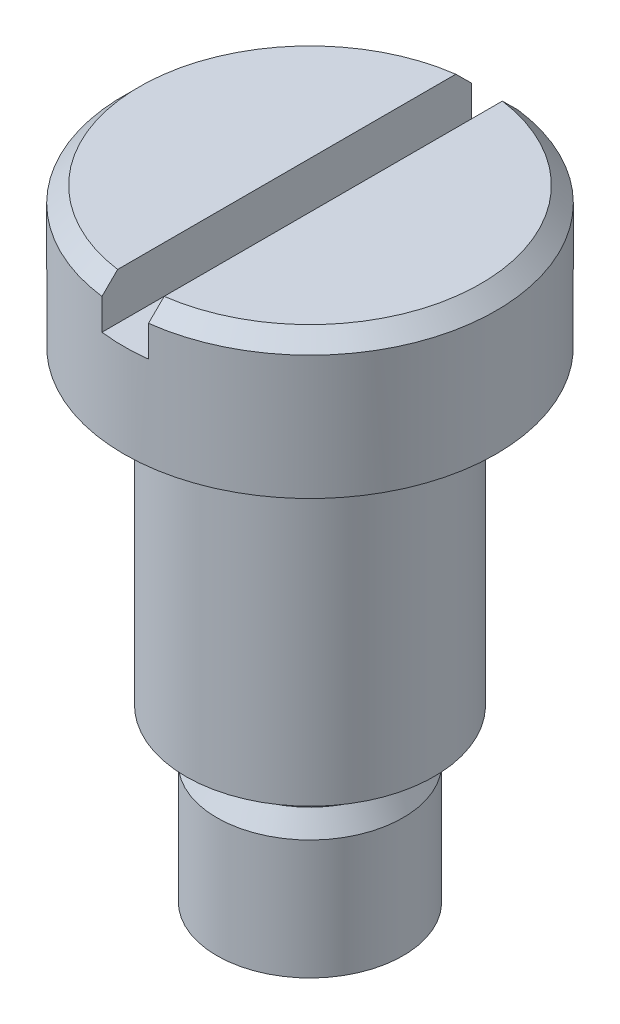
ISO-10303-21;
HEADER;
FILE_DESCRIPTION(('STEP AP214'),'2;1');
FILE_NAME('part.step','',(''),(''),'','','');
FILE_SCHEMA(('AUTOMOTIVE_DESIGN { 1 0 10303 214 1 1 1 1 }'));
ENDSEC;
DATA;
#1=APPLICATION_CONTEXT('core data for automotive mechanical design processes');
#2=APPLICATION_PROTOCOL_DEFINITION('international standard','automotive_design',2000,#1);
#3=PRODUCT_CONTEXT('',#1,'mechanical');
#4=PRODUCT('Part','Part','',(#3));
#5=PRODUCT_RELATED_PRODUCT_CATEGORY('part','',(#4));
#6=PRODUCT_DEFINITION_FORMATION('','',#4);
#7=PRODUCT_DEFINITION_CONTEXT('part definition',#1,'design');
#8=PRODUCT_DEFINITION('design','',#6,#7);
#9=PRODUCT_DEFINITION_SHAPE('','',#8);
#10=(LENGTH_UNIT() NAMED_UNIT(*) SI_UNIT(.MILLI.,.METRE.));
#11=(NAMED_UNIT(*) PLANE_ANGLE_UNIT() SI_UNIT($,.RADIAN.));
#12=(NAMED_UNIT(*) SI_UNIT($,.STERADIAN.) SOLID_ANGLE_UNIT());
#13=UNCERTAINTY_MEASURE_WITH_UNIT(LENGTH_MEASURE(1.E-05),#10,'distance_accuracy_value','');
#14=(GEOMETRIC_REPRESENTATION_CONTEXT(3) GLOBAL_UNCERTAINTY_ASSIGNED_CONTEXT((#13)) GLOBAL_UNIT_ASSIGNED_CONTEXT((#10,
#11,#12)) REPRESENTATION_CONTEXT('',''));
#15=CARTESIAN_POINT('',(0.,0.,0.));
#16=DIRECTION('',(0.,0.,1.));
#17=DIRECTION('',(1.,0.,0.));
#18=AXIS2_PLACEMENT_3D('',#15,#16,#17);
#19=CARTESIAN_POINT('',(0.,40.,0.));
#20=DIRECTION('',(0.,1.,0.));
#21=DIRECTION('',(0.,0.,1.));
#22=AXIS2_PLACEMENT_3D('',#19,#20,#21);
#23=PLANE('',#22);
#24=DIRECTION('',(0.,0.,1.));
#25=VECTOR('',#24,1.);
#26=CARTESIAN_POINT('',(-1.5,40.,-12.));
#27=LINE('',#26,#25);
#28=CARTESIAN_POINT('',(-1.5,40.,-10.8972473588517));
#29=VERTEX_POINT('',#28);
#30=CARTESIAN_POINT('',(-1.5,40.,10.8972473588517));
#31=VERTEX_POINT('',#30);
#32=EDGE_CURVE('E191',#29,#31,#27,.T.);
#33=ORIENTED_EDGE('',*,*,#32,.F.);
#34=CARTESIAN_POINT('',(0.,40.,0.));
#35=DIRECTION('',(0.,1.,0.));
#36=DIRECTION('',(0.,0.,1.));
#37=AXIS2_PLACEMENT_3D('',#34,#35,#36);
#38=CIRCLE('',#37,11.);
#39=EDGE_CURVE('E11',#29,#31,#38,.T.);
#40=ORIENTED_EDGE('',*,*,#39,.T.);
#41=EDGE_LOOP('',(#33,#40));
#42=FACE_BOUND('',#41,.T.);
#43=ADVANCED_FACE('F51',(#42),#23,.T.);
#44=DIRECTION('',(0.,0.,1.));
#45=VECTOR('',#44,1.);
#46=CARTESIAN_POINT('',(1.5,40.,-12.));
#47=LINE('',#46,#45);
#48=CARTESIAN_POINT('',(1.5,40.,-10.8972473588517));
#49=VERTEX_POINT('',#48);
#50=CARTESIAN_POINT('',(1.5,40.,10.8972473588517));
#51=VERTEX_POINT('',#50);
#52=EDGE_CURVE('E123',#49,#51,#47,.T.);
#53=ORIENTED_EDGE('',*,*,#52,.T.);
#54=CARTESIAN_POINT('',(0.,40.,0.));
#55=DIRECTION('',(0.,1.,0.));
#56=DIRECTION('',(0.,0.,1.));
#57=AXIS2_PLACEMENT_3D('',#54,#55,#56);
#58=CIRCLE('',#57,11.);
#59=EDGE_CURVE('E182',#51,#49,#58,.T.);
#60=ORIENTED_EDGE('',*,*,#59,.T.);
#61=EDGE_LOOP('',(#53,#60));
#62=FACE_BOUND('',#61,.T.);
#63=ADVANCED_FACE('F190',(#62),#23,.T.);
#64=CARTESIAN_POINT('',(0.,0.,0.));
#65=DIRECTION('',(0.,-1.,0.));
#66=DIRECTION('',(0.,0.,-1.));
#67=AXIS2_PLACEMENT_3D('',#64,#65,#66);
#68=CYLINDRICAL_SURFACE('',#67,12.);
#69=DIRECTION('',(0.,-1.,0.));
#70=VECTOR('',#69,1.);
#71=CARTESIAN_POINT('',(1.49999999999997,0.,-11.9058808997907));
#72=LINE('',#71,#70);
#73=CARTESIAN_POINT('',(1.49999999999997,39.,-11.9058808997907));
#74=VERTEX_POINT('',#73);
#75=CARTESIAN_POINT('',(1.5,37.,-11.9058808997907));
#76=VERTEX_POINT('',#75);
#77=EDGE_CURVE('E122',#74,#76,#72,.T.);
#78=ORIENTED_EDGE('',*,*,#77,.F.);
#79=CARTESIAN_POINT('',(0.,39.,0.));
#80=DIRECTION('',(0.,1.,0.));
#81=DIRECTION('',(0.,0.,1.));
#82=AXIS2_PLACEMENT_3D('',#79,#80,#81);
#83=CIRCLE('',#82,12.);
#84=CARTESIAN_POINT('',(1.49999999999997,39.,11.9058808997907));
#85=VERTEX_POINT('',#84);
#86=EDGE_CURVE('E129',#74,#85,#83,.F.);
#87=ORIENTED_EDGE('',*,*,#86,.T.);
#88=DIRECTION('',(0.,-1.,0.));
#89=VECTOR('',#88,1.);
#90=CARTESIAN_POINT('',(1.49999999999997,0.,11.9058808997907));
#91=LINE('',#90,#89);
#92=CARTESIAN_POINT('',(1.5,37.,11.9058808997907));
#93=VERTEX_POINT('',#92);
#94=EDGE_CURVE('E114',#93,#85,#91,.F.);
#95=ORIENTED_EDGE('',*,*,#94,.F.);
#96=CARTESIAN_POINT('',(0.,37.,0.));
#97=DIRECTION('',(0.,-1.,0.));
#98=DIRECTION('',(0.,0.,-1.));
#99=AXIS2_PLACEMENT_3D('',#96,#97,#98);
#100=CIRCLE('',#99,12.);
#101=CARTESIAN_POINT('',(-1.5,37.,11.9058808997907));
#102=VERTEX_POINT('',#101);
#103=EDGE_CURVE('E104',#102,#93,#100,.F.);
#104=ORIENTED_EDGE('',*,*,#103,.F.);
#105=DIRECTION('',(0.,-1.,0.));
#106=VECTOR('',#105,1.);
#107=CARTESIAN_POINT('',(-1.5,0.,11.9058808997907));
#108=LINE('',#107,#106);
#109=CARTESIAN_POINT('',(-1.5,39.,11.9058808997907));
#110=VERTEX_POINT('',#109);
#111=EDGE_CURVE('E134',#110,#102,#108,.T.);
#112=ORIENTED_EDGE('',*,*,#111,.F.);
#113=CARTESIAN_POINT('',(0.,39.,0.));
#114=DIRECTION('',(0.,1.,0.));
#115=DIRECTION('',(0.,0.,1.));
#116=AXIS2_PLACEMENT_3D('',#113,#114,#115);
#117=CIRCLE('',#116,12.);
#118=CARTESIAN_POINT('',(-1.5,39.,-11.9058808997907));
#119=VERTEX_POINT('',#118);
#120=EDGE_CURVE('E138',#110,#119,#117,.F.);
#121=ORIENTED_EDGE('',*,*,#120,.T.);
#122=DIRECTION('',(0.,-1.,0.));
#123=VECTOR('',#122,1.);
#124=CARTESIAN_POINT('',(-1.5,0.,-11.9058808997907));
#125=LINE('',#124,#123);
#126=CARTESIAN_POINT('',(-1.5,37.,-11.9058808997907));
#127=VERTEX_POINT('',#126);
#128=EDGE_CURVE('E136',#127,#119,#125,.F.);
#129=ORIENTED_EDGE('',*,*,#128,.F.);
#130=EDGE_CURVE('E117',#76,#127,#100,.F.);
#131=ORIENTED_EDGE('',*,*,#130,.F.);
#132=EDGE_LOOP('',(#78,#87,#95,#104,#112,#121,#129,#131));
#133=FACE_BOUND('',#132,.T.);
#134=CARTESIAN_POINT('',(0.,31.,0.));
#135=DIRECTION('',(0.,-1.,0.));
#136=DIRECTION('',(0.,0.,-1.));
#137=AXIS2_PLACEMENT_3D('',#134,#135,#136);
#138=CIRCLE('',#137,12.);
#139=CARTESIAN_POINT('',(0.,31.,-12.));
#140=VERTEX_POINT('',#139);
#141=EDGE_CURVE('E115',#140,#140,#138,.T.);
#142=ORIENTED_EDGE('',*,*,#141,.F.);
#143=EDGE_LOOP('',(#142));
#144=FACE_BOUND('',#143,.T.);
#145=ADVANCED_FACE('F126',(#133,#144),#68,.T.);
#146=CARTESIAN_POINT('',(12.,31.,0.));
#147=DIRECTION('',(0.,-1.,0.));
#148=DIRECTION('',(0.,0.,-1.));
#149=AXIS2_PLACEMENT_3D('',#146,#147,#148);
#150=PLANE('',#149);
#151=ORIENTED_EDGE('',*,*,#141,.T.);
#152=EDGE_LOOP('',(#151));
#153=FACE_BOUND('',#152,.T.);
#154=CARTESIAN_POINT('',(0.,31.,0.));
#155=DIRECTION('',(0.,-1.,0.));
#156=DIRECTION('',(0.,0.,-1.));
#157=AXIS2_PLACEMENT_3D('',#154,#155,#156);
#158=CIRCLE('',#157,8.);
#159=CARTESIAN_POINT('',(0.,31.,-8.));
#160=VERTEX_POINT('',#159);
#161=EDGE_CURVE('E211',#160,#160,#158,.T.);
#162=ORIENTED_EDGE('',*,*,#161,.F.);
#163=EDGE_LOOP('',(#162));
#164=FACE_BOUND('',#163,.T.);
#165=ADVANCED_FACE('F216',(#153,#164),#150,.T.);
#166=CARTESIAN_POINT('',(0.,0.,0.));
#167=DIRECTION('',(0.,-1.,0.));
#168=DIRECTION('',(0.,0.,-1.));
#169=AXIS2_PLACEMENT_3D('',#166,#167,#168);
#170=CYLINDRICAL_SURFACE('',#169,8.);
#171=ORIENTED_EDGE('',*,*,#161,.T.);
#172=EDGE_LOOP('',(#171));
#173=FACE_BOUND('',#172,.T.);
#174=CARTESIAN_POINT('',(0.,11.,0.));
#175=DIRECTION('',(0.,-1.,0.));
#176=DIRECTION('',(0.,0.,-1.));
#177=AXIS2_PLACEMENT_3D('',#174,#175,#176);
#178=CIRCLE('',#177,8.);
#179=CARTESIAN_POINT('',(0.,11.,-8.));
#180=VERTEX_POINT('',#179);
#181=EDGE_CURVE('E208',#180,#180,#178,.T.);
#182=ORIENTED_EDGE('',*,*,#181,.F.);
#183=EDGE_LOOP('',(#182));
#184=FACE_BOUND('',#183,.T.);
#185=ADVANCED_FACE('F224',(#173,#184),#170,.T.);
#186=CARTESIAN_POINT('',(8.,11.,0.));
#187=DIRECTION('',(0.,-1.,0.));
#188=DIRECTION('',(0.,0.,-1.));
#189=AXIS2_PLACEMENT_3D('',#186,#187,#188);
#190=PLANE('',#189);
#191=ORIENTED_EDGE('',*,*,#181,.T.);
#192=EDGE_LOOP('',(#191));
#193=FACE_BOUND('',#192,.T.);
#194=CARTESIAN_POINT('',(0.,11.,0.));
#195=DIRECTION('',(0.,-1.,0.));
#196=DIRECTION('',(0.,0.,-1.));
#197=AXIS2_PLACEMENT_3D('',#194,#195,#196);
#198=CIRCLE('',#197,5.25);
#199=CARTESIAN_POINT('',(0.,11.,-5.25));
#200=VERTEX_POINT('',#199);
#201=EDGE_CURVE('E205',#200,#200,#198,.T.);
#202=ORIENTED_EDGE('',*,*,#201,.F.);
#203=EDGE_LOOP('',(#202));
#204=FACE_BOUND('',#203,.T.);
#205=ADVANCED_FACE('F294',(#193,#204),#190,.T.);
#206=CARTESIAN_POINT('',(0.,0.,0.));
#207=DIRECTION('',(0.,-1.,0.));
#208=DIRECTION('',(0.,0.,-1.));
#209=AXIS2_PLACEMENT_3D('',#206,#207,#208);
#210=CYLINDRICAL_SURFACE('',#209,5.25);
#211=ORIENTED_EDGE('',*,*,#201,.T.);
#212=EDGE_LOOP('',(#211));
#213=FACE_BOUND('',#212,.T.);
#214=CARTESIAN_POINT('',(0.,9.,0.));
#215=DIRECTION('',(0.,-1.,0.));
#216=DIRECTION('',(0.,0.,-1.));
#217=AXIS2_PLACEMENT_3D('',#214,#215,#216);
#218=CIRCLE('',#217,5.25);
#219=CARTESIAN_POINT('',(0.,9.,-5.25));
#220=VERTEX_POINT('',#219);
#221=EDGE_CURVE('E202',#220,#220,#218,.T.);
#222=ORIENTED_EDGE('',*,*,#221,.F.);
#223=EDGE_LOOP('',(#222));
#224=FACE_BOUND('',#223,.T.);
#225=ADVANCED_FACE('F284',(#213,#224),#210,.T.);
#226=CARTESIAN_POINT('',(0.,7.70096189432335,0.));
#227=DIRECTION('',(0.,-1.,0.));
#228=DIRECTION('',(0.,0.,-1.));
#229=AXIS2_PLACEMENT_3D('',#226,#227,#228);
#230=CONICAL_SURFACE('',#229,6.,0.5235987755983);
#231=ORIENTED_EDGE('',*,*,#221,.T.);
#232=EDGE_LOOP('',(#231));
#233=FACE_BOUND('',#232,.T.);
#234=CARTESIAN_POINT('',(0.,7.70096189432335,0.));
#235=DIRECTION('',(0.,-1.,0.));
#236=DIRECTION('',(0.,0.,-1.));
#237=AXIS2_PLACEMENT_3D('',#234,#235,#236);
#238=CIRCLE('',#237,6.);
#239=CARTESIAN_POINT('',(0.,7.70096189432335,-6.));
#240=VERTEX_POINT('',#239);
#241=EDGE_CURVE('E199',#240,#240,#238,.T.);
#242=ORIENTED_EDGE('',*,*,#241,.F.);
#243=EDGE_LOOP('',(#242));
#244=FACE_BOUND('',#243,.T.);
#245=ADVANCED_FACE('F274',(#233,#244),#230,.T.);
#246=CARTESIAN_POINT('',(0.,0.,0.));
#247=DIRECTION('',(0.,-1.,0.));
#248=DIRECTION('',(0.,0.,-1.));
#249=AXIS2_PLACEMENT_3D('',#246,#247,#248);
#250=CYLINDRICAL_SURFACE('',#249,6.);
#251=ORIENTED_EDGE('',*,*,#241,.T.);
#252=EDGE_LOOP('',(#251));
#253=FACE_BOUND('',#252,.T.);
#254=CARTESIAN_POINT('',(0.,0.,0.));
#255=DIRECTION('',(0.,-1.,0.));
#256=DIRECTION('',(0.,0.,-1.));
#257=AXIS2_PLACEMENT_3D('',#254,#255,#256);
#258=CIRCLE('',#257,6.);
#259=CARTESIAN_POINT('',(0.,0.,-6.));
#260=VERTEX_POINT('',#259);
#261=EDGE_CURVE('E196',#260,#260,#258,.T.);
#262=ORIENTED_EDGE('',*,*,#261,.F.);
#263=EDGE_LOOP('',(#262));
#264=FACE_BOUND('',#263,.T.);
#265=ADVANCED_FACE('F264',(#253,#264),#250,.T.);
#266=CARTESIAN_POINT('',(6.,0.,0.));
#267=DIRECTION('',(0.,-1.,0.));
#268=DIRECTION('',(0.,0.,-1.));
#269=AXIS2_PLACEMENT_3D('',#266,#267,#268);
#270=PLANE('',#269);
#271=ORIENTED_EDGE('',*,*,#261,.T.);
#272=EDGE_LOOP('',(#271));
#273=FACE_BOUND('',#272,.T.);
#274=ADVANCED_FACE('F169',(#273),#270,.T.);
#275=CARTESIAN_POINT('',(-1.5,40.,-12.));
#276=DIRECTION('',(-1.,0.,0.));
#277=DIRECTION('',(0.,0.,1.));
#278=AXIS2_PLACEMENT_3D('',#275,#276,#277);
#279=PLANE('',#278);
#280=ORIENTED_EDGE('',*,*,#128,.T.);
#281=CARTESIAN_POINT('',(-1.5,39.,-11.9058808997907));
#282=CARTESIAN_POINT('',(-1.5,39.1667300384904,-11.7378381395328));
#283=CARTESIAN_POINT('',(-1.5,39.3334283909403,-11.5697639644555));
#284=CARTESIAN_POINT('',(-1.5,39.6667617242738,-11.2335527841427));
#285=CARTESIAN_POINT('',(-1.5,39.8333967051573,-11.065415778907));
#286=CARTESIAN_POINT('',(-1.5,40.,-10.8972473588517));
#287=B_SPLINE_CURVE_WITH_KNOTS('',3,(#281,#282,#283,#284,#285,#286),.UNSPECIFIED.,.F.,.F.,(4,2,
4),(0.,0.710165770321781,1.42033154283759),.UNSPECIFIED.);
#288=EDGE_CURVE('E61',#119,#29,#287,.T.);
#289=ORIENTED_EDGE('',*,*,#288,.T.);
#290=ORIENTED_EDGE('',*,*,#32,.T.);
#291=CARTESIAN_POINT('',(-1.5,40.,10.8972473588517));
#292=CARTESIAN_POINT('',(-1.5,39.8333967051573,11.065415778907));
#293=CARTESIAN_POINT('',(-1.5,39.6667617242738,11.2335527841427));
#294=CARTESIAN_POINT('',(-1.5,39.3334283909403,11.5697639644555));
#295=CARTESIAN_POINT('',(-1.5,39.1667300384904,11.7378381395328));
#296=CARTESIAN_POINT('',(-1.5,39.,11.9058808997907));
#297=B_SPLINE_CURVE_WITH_KNOTS('',3,(#291,#292,#293,#294,#295,#296),.UNSPECIFIED.,.F.,.F.,(4,2,
4),(0.,0.710165772515807,1.42033154283759),.UNSPECIFIED.);
#298=EDGE_CURVE('E173',#31,#110,#297,.T.);
#299=ORIENTED_EDGE('',*,*,#298,.T.);
#300=ORIENTED_EDGE('',*,*,#111,.T.);
#301=DIRECTION('',(0.,0.,1.));
#302=VECTOR('',#301,1.);
#303=CARTESIAN_POINT('',(-1.5,37.,-12.));
#304=LINE('',#303,#302);
#305=EDGE_CURVE('E110',#127,#102,#304,.T.);
#306=ORIENTED_EDGE('',*,*,#305,.F.);
#307=EDGE_LOOP('',(#280,#289,#290,#299,#300,#306));
#308=FACE_BOUND('',#307,.T.);
#309=ADVANCED_FACE('F162',(#308),#279,.F.);
#310=CARTESIAN_POINT('',(1.5,40.,-12.));
#311=DIRECTION('',(1.,0.,0.));
#312=DIRECTION('',(0.,1.,0.));
#313=AXIS2_PLACEMENT_3D('',#310,#311,#312);
#314=PLANE('',#313);
#315=ORIENTED_EDGE('',*,*,#94,.T.);
#316=CARTESIAN_POINT('',(1.49999999999997,39.,11.9058808997907));
#317=CARTESIAN_POINT('',(1.49999999999999,39.1667300384904,11.7378381395328));
#318=CARTESIAN_POINT('',(1.5,39.3334283909403,11.5697639644555));
#319=CARTESIAN_POINT('',(1.50000000000001,39.6667617242738,11.2335527841427));
#320=CARTESIAN_POINT('',(1.50000000000001,39.8333967051573,11.065415778907));
#321=CARTESIAN_POINT('',(1.5,40.,10.8972473588517));
#322=B_SPLINE_CURVE_WITH_KNOTS('',3,(#316,#317,#318,#319,#320,#321),.UNSPECIFIED.,.F.,.F.,(4,2,
4),(0.,0.710165770321783,1.42033154283759),.UNSPECIFIED.);
#323=EDGE_CURVE('E149',#85,#51,#322,.T.);
#324=ORIENTED_EDGE('',*,*,#323,.T.);
#325=ORIENTED_EDGE('',*,*,#52,.F.);
#326=CARTESIAN_POINT('',(1.5,40.,-10.8972473588517));
#327=CARTESIAN_POINT('',(1.5,39.8333967051573,-11.065415778907));
#328=CARTESIAN_POINT('',(1.5,39.6667617242738,-11.2335527841427));
#329=CARTESIAN_POINT('',(1.5,39.3334283909403,-11.5697639644555));
#330=CARTESIAN_POINT('',(1.5,39.1667300384904,-11.7378381395328));
#331=CARTESIAN_POINT('',(1.5,39.,-11.9058808997907));
#332=B_SPLINE_CURVE_WITH_KNOTS('',3,(#326,#327,#328,#329,#330,#331),.UNSPECIFIED.,.F.,.F.,(4,2,
4),(0.,0.710165772515807,1.42033154283759),.UNSPECIFIED.);
#333=EDGE_CURVE('E142',#49,#74,#332,.T.);
#334=ORIENTED_EDGE('',*,*,#333,.T.);
#335=ORIENTED_EDGE('',*,*,#77,.T.);
#336=DIRECTION('',(0.,0.,1.));
#337=VECTOR('',#336,1.);
#338=CARTESIAN_POINT('',(1.5,37.,-12.));
#339=LINE('',#338,#337);
#340=EDGE_CURVE('E107',#76,#93,#339,.T.);
#341=ORIENTED_EDGE('',*,*,#340,.T.);
#342=EDGE_LOOP('',(#315,#324,#325,#334,#335,#341));
#343=FACE_BOUND('',#342,.T.);
#344=ADVANCED_FACE('F120',(#343),#314,.F.);
#345=CARTESIAN_POINT('',(-1.5,37.,-12.));
#346=DIRECTION('',(0.,-1.,0.));
#347=DIRECTION('',(0.,0.,-1.));
#348=AXIS2_PLACEMENT_3D('',#345,#346,#347);
#349=PLANE('',#348);
#350=ORIENTED_EDGE('',*,*,#305,.T.);
#351=ORIENTED_EDGE('',*,*,#103,.T.);
#352=ORIENTED_EDGE('',*,*,#340,.F.);
#353=ORIENTED_EDGE('',*,*,#130,.T.);
#354=EDGE_LOOP('',(#350,#351,#352,#353));
#355=FACE_BOUND('',#354,.T.);
#356=ADVANCED_FACE('F106',(#355),#349,.F.);
#357=CARTESIAN_POINT('',(0.,39.,0.));
#358=DIRECTION('',(0.,-1.,0.));
#359=DIRECTION('',(0.,0.,-1.));
#360=AXIS2_PLACEMENT_3D('',#357,#358,#359);
#361=CONICAL_SURFACE('',#360,12.,0.785398163397453);
#362=ORIENTED_EDGE('',*,*,#333,.F.);
#363=ORIENTED_EDGE('',*,*,#59,.F.);
#364=ORIENTED_EDGE('',*,*,#323,.F.);
#365=ORIENTED_EDGE('',*,*,#86,.F.);
#366=EDGE_LOOP('',(#362,#363,#364,#365));
#367=FACE_BOUND('',#366,.T.);
#368=ADVANCED_FACE('F156',(#367),#361,.T.);
#369=CARTESIAN_POINT('',(0.,39.,0.));
#370=DIRECTION('',(0.,-1.,0.));
#371=DIRECTION('',(0.,0.,-1.));
#372=AXIS2_PLACEMENT_3D('',#369,#370,#371);
#373=CONICAL_SURFACE('',#372,12.,0.785398163397453);
#374=ORIENTED_EDGE('',*,*,#298,.F.);
#375=ORIENTED_EDGE('',*,*,#39,.F.);
#376=ORIENTED_EDGE('',*,*,#288,.F.);
#377=ORIENTED_EDGE('',*,*,#120,.F.);
#378=EDGE_LOOP('',(#374,#375,#376,#377));
#379=FACE_BOUND('',#378,.T.);
#380=ADVANCED_FACE('F54',(#379),#373,.T.);
#381=CLOSED_SHELL('',(#43,#63,#145,#165,#185,#205,#225,#245,#265,#274,#309,#344,#356,#368,#380));
#382=MANIFOLD_SOLID_BREP('B2',#381);
#383=ADVANCED_BREP_SHAPE_REPRESENTATION('',(#18,#382),#14);
#384=SHAPE_DEFINITION_REPRESENTATION(#9,#383);
ENDSEC;
END-ISO-10303-21;
